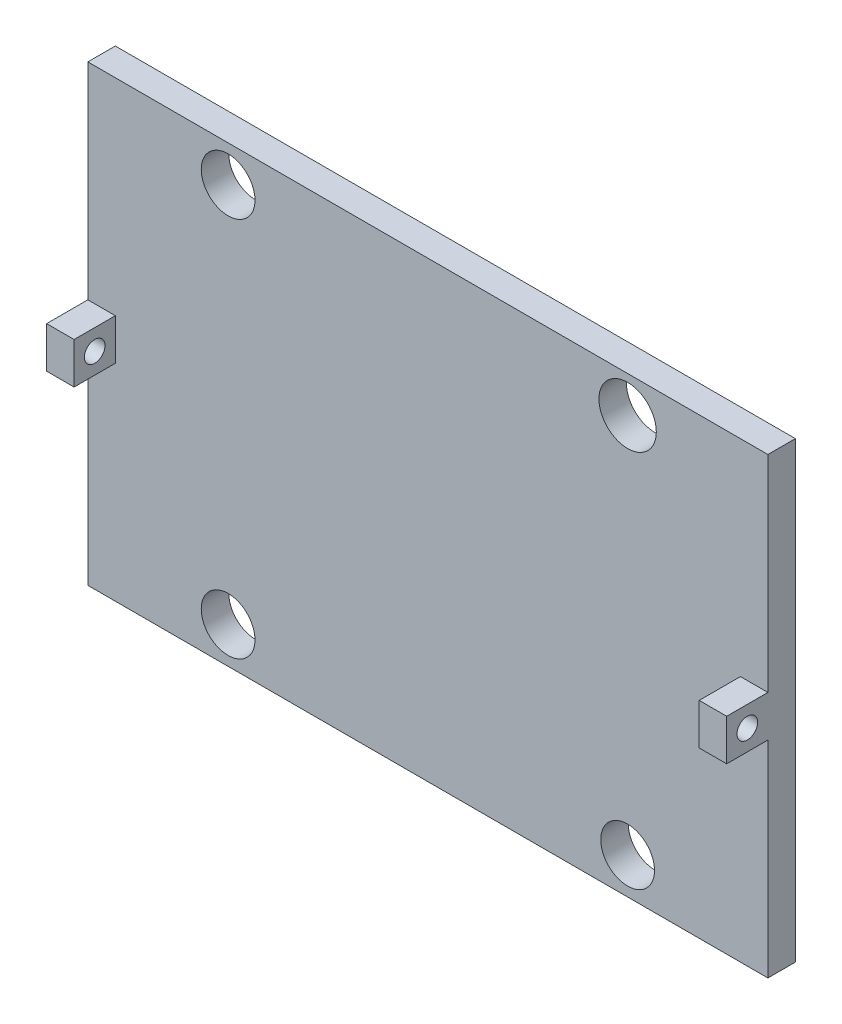
ISO-10303-21;
HEADER;
FILE_DESCRIPTION(('STEP AP214'),'2;1');
FILE_NAME('part.step','',(''),(''),'','','');
FILE_SCHEMA(('AUTOMOTIVE_DESIGN { 1 0 10303 214 1 1 1 1 }'));
ENDSEC;
DATA;
#1=APPLICATION_CONTEXT('core data for automotive mechanical design processes');
#2=APPLICATION_PROTOCOL_DEFINITION('international standard','automotive_design',2000,#1);
#3=PRODUCT_CONTEXT('',#1,'mechanical');
#4=PRODUCT('Part','Part','',(#3));
#5=PRODUCT_RELATED_PRODUCT_CATEGORY('part','',(#4));
#6=PRODUCT_DEFINITION_FORMATION('','',#4);
#7=PRODUCT_DEFINITION_CONTEXT('part definition',#1,'design');
#8=PRODUCT_DEFINITION('design','',#6,#7);
#9=PRODUCT_DEFINITION_SHAPE('','',#8);
#10=(LENGTH_UNIT() NAMED_UNIT(*) SI_UNIT(.MILLI.,.METRE.));
#11=(NAMED_UNIT(*) PLANE_ANGLE_UNIT() SI_UNIT($,.RADIAN.));
#12=(NAMED_UNIT(*) SI_UNIT($,.STERADIAN.) SOLID_ANGLE_UNIT());
#13=UNCERTAINTY_MEASURE_WITH_UNIT(LENGTH_MEASURE(1.E-05),#10,'distance_accuracy_value','');
#14=(GEOMETRIC_REPRESENTATION_CONTEXT(3) GLOBAL_UNCERTAINTY_ASSIGNED_CONTEXT((#13)) GLOBAL_UNIT_ASSIGNED_CONTEXT((#10,
#11,#12)) REPRESENTATION_CONTEXT('',''));
#15=CARTESIAN_POINT('',(0.,0.,0.));
#16=DIRECTION('',(0.,0.,1.));
#17=DIRECTION('',(1.,0.,0.));
#18=AXIS2_PLACEMENT_3D('',#15,#16,#17);
#19=CARTESIAN_POINT('',(0.,0.,2.));
#20=DIRECTION('',(0.,0.,1.));
#21=DIRECTION('',(1.,0.,0.));
#22=AXIS2_PLACEMENT_3D('',#19,#20,#21);
#23=PLANE('',#22);
#24=CARTESIAN_POINT('',(-21.5144389027431,-20.1717847880299,2.));
#25=DIRECTION('',(0.,0.,1.));
#26=DIRECTION('',(1.,0.,0.));
#27=AXIS2_PLACEMENT_3D('',#24,#25,#26);
#28=CIRCLE('',#27,1.9558);
#29=CARTESIAN_POINT('',(-19.5586389027431,-20.1717847880299,2.));
#30=VERTEX_POINT('',#29);
#31=EDGE_CURVE('E429',#30,#30,#28,.T.);
#32=ORIENTED_EDGE('',*,*,#31,.F.);
#33=EDGE_LOOP('',(#32));
#34=FACE_BOUND('',#33,.T.);
#35=CARTESIAN_POINT('',(-21.5144389027431,7.53961521197007,2.));
#36=DIRECTION('',(0.,0.,1.));
#37=DIRECTION('',(1.,0.,0.));
#38=AXIS2_PLACEMENT_3D('',#35,#36,#37);
#39=CIRCLE('',#38,1.9558);
#40=CARTESIAN_POINT('',(-19.5586389027431,7.53961521197007,2.));
#41=VERTEX_POINT('',#40);
#42=EDGE_CURVE('E439',#41,#41,#39,.T.);
#43=ORIENTED_EDGE('',*,*,#42,.F.);
#44=EDGE_LOOP('',(#43));
#45=FACE_BOUND('',#44,.T.);
#46=CARTESIAN_POINT('',(7.56556109725687,-20.1717847880299,2.));
#47=DIRECTION('',(0.,0.,1.));
#48=DIRECTION('',(1.,0.,0.));
#49=AXIS2_PLACEMENT_3D('',#46,#47,#48);
#50=CIRCLE('',#49,1.9558);
#51=CARTESIAN_POINT('',(9.52136109725687,-20.1717847880299,2.));
#52=VERTEX_POINT('',#51);
#53=EDGE_CURVE('E445',#52,#52,#50,.T.);
#54=ORIENTED_EDGE('',*,*,#53,.F.);
#55=EDGE_LOOP('',(#54));
#56=FACE_BOUND('',#55,.T.);
#57=CARTESIAN_POINT('',(7.56556109725687,7.53961521197007,2.));
#58=DIRECTION('',(0.,0.,1.));
#59=DIRECTION('',(1.,0.,0.));
#60=AXIS2_PLACEMENT_3D('',#57,#58,#59);
#61=CIRCLE('',#60,2.08701189447507);
#62=CARTESIAN_POINT('',(9.65257299173194,7.53961521197007,2.));
#63=VERTEX_POINT('',#62);
#64=EDGE_CURVE('E451',#63,#63,#61,.T.);
#65=ORIENTED_EDGE('',*,*,#64,.F.);
#66=EDGE_LOOP('',(#65));
#67=FACE_BOUND('',#66,.T.);
#68=DIRECTION('',(0.,1.,0.));
#69=VECTOR('',#68,1.);
#70=CARTESIAN_POINT('',(17.7755610972569,10.1839152119701,2.));
#71=LINE('',#70,#69);
#72=CARTESIAN_POINT('',(17.7755610972569,-22.8160847880299,2.));
#73=VERTEX_POINT('',#72);
#74=CARTESIAN_POINT('',(17.7755610972569,-7.81608478802993,2.));
#75=VERTEX_POINT('',#74);
#76=EDGE_CURVE('E233',#73,#75,#71,.T.);
#77=ORIENTED_EDGE('',*,*,#76,.T.);
#78=DIRECTION('',(1.,0.,0.));
#79=VECTOR('',#78,1.);
#80=CARTESIAN_POINT('',(17.7755610972569,-7.81608478802993,2.));
#81=LINE('',#80,#79);
#82=CARTESIAN_POINT('',(15.7755610972569,-7.81608478802993,2.));
#83=VERTEX_POINT('',#82);
#84=EDGE_CURVE('E157',#83,#75,#81,.T.);
#85=ORIENTED_EDGE('',*,*,#84,.F.);
#86=DIRECTION('',(0.,-1.,0.));
#87=VECTOR('',#86,1.);
#88=CARTESIAN_POINT('',(15.7755610972569,-7.81608478802993,2.));
#89=LINE('',#88,#87);
#90=CARTESIAN_POINT('',(15.7755610972569,-4.81608478802993,2.));
#91=VERTEX_POINT('',#90);
#92=EDGE_CURVE('E140',#91,#83,#89,.T.);
#93=ORIENTED_EDGE('',*,*,#92,.F.);
#94=DIRECTION('',(-1.,0.,0.));
#95=VECTOR('',#94,1.);
#96=CARTESIAN_POINT('',(15.7755610972569,-4.81608478802993,2.));
#97=LINE('',#96,#95);
#98=CARTESIAN_POINT('',(17.7755610972569,-4.81608478802993,2.));
#99=VERTEX_POINT('',#98);
#100=EDGE_CURVE('E134',#99,#91,#97,.T.);
#101=ORIENTED_EDGE('',*,*,#100,.F.);
#102=CARTESIAN_POINT('',(17.7755610972569,10.1839152119701,2.));
#103=VERTEX_POINT('',#102);
#104=EDGE_CURVE('E235',#99,#103,#71,.T.);
#105=ORIENTED_EDGE('',*,*,#104,.T.);
#106=DIRECTION('',(-1.,0.,0.));
#107=VECTOR('',#106,1.);
#108=CARTESIAN_POINT('',(-31.7244389027431,10.1839152119701,2.));
#109=LINE('',#108,#107);
#110=CARTESIAN_POINT('',(-31.7244389027431,10.1839152119701,2.));
#111=VERTEX_POINT('',#110);
#112=EDGE_CURVE('E224',#103,#111,#109,.T.);
#113=ORIENTED_EDGE('',*,*,#112,.T.);
#114=DIRECTION('',(0.,-1.,0.));
#115=VECTOR('',#114,1.);
#116=CARTESIAN_POINT('',(-31.7244389027431,10.1839152119701,2.));
#117=LINE('',#116,#115);
#118=CARTESIAN_POINT('',(-31.7244389027431,-4.81608478802993,2.));
#119=VERTEX_POINT('',#118);
#120=EDGE_CURVE('E214',#111,#119,#117,.T.);
#121=ORIENTED_EDGE('',*,*,#120,.T.);
#122=DIRECTION('',(-1.,0.,0.));
#123=VECTOR('',#122,1.);
#124=CARTESIAN_POINT('',(-31.7244389027431,-4.81608478802993,2.));
#125=LINE('',#124,#123);
#126=CARTESIAN_POINT('',(-29.7244389027431,-4.81608478802993,2.));
#127=VERTEX_POINT('',#126);
#128=EDGE_CURVE('E168',#127,#119,#125,.T.);
#129=ORIENTED_EDGE('',*,*,#128,.F.);
#130=DIRECTION('',(0.,1.,0.));
#131=VECTOR('',#130,1.);
#132=CARTESIAN_POINT('',(-29.7244389027431,-4.81608478802993,2.));
#133=LINE('',#132,#131);
#134=CARTESIAN_POINT('',(-29.7244389027431,-7.81608478802993,2.));
#135=VERTEX_POINT('',#134);
#136=EDGE_CURVE('E58',#135,#127,#133,.T.);
#137=ORIENTED_EDGE('',*,*,#136,.F.);
#138=DIRECTION('',(1.,0.,0.));
#139=VECTOR('',#138,1.);
#140=CARTESIAN_POINT('',(-29.7244389027431,-7.81608478802993,2.));
#141=LINE('',#140,#139);
#142=CARTESIAN_POINT('',(-31.7244389027431,-7.81608478802993,2.));
#143=VERTEX_POINT('',#142);
#144=EDGE_CURVE('E143',#143,#135,#141,.T.);
#145=ORIENTED_EDGE('',*,*,#144,.F.);
#146=CARTESIAN_POINT('',(-31.7244389027431,-22.8160847880299,2.));
#147=VERTEX_POINT('',#146);
#148=EDGE_CURVE('E211',#143,#147,#117,.T.);
#149=ORIENTED_EDGE('',*,*,#148,.T.);
#150=DIRECTION('',(1.,0.,0.));
#151=VECTOR('',#150,1.);
#152=CARTESIAN_POINT('',(-31.7244389027431,-22.8160847880299,2.));
#153=LINE('',#152,#151);
#154=EDGE_CURVE('E207',#147,#73,#153,.T.);
#155=ORIENTED_EDGE('',*,*,#154,.T.);
#156=EDGE_LOOP('',(#77,#85,#93,#101,#105,#113,#121,#129,#137,#145,#149,#155));
#157=FACE_BOUND('',#156,.T.);
#158=ADVANCED_FACE('F33',(#34,#45,#56,#67,#157),#23,.T.);
#159=CARTESIAN_POINT('',(-31.7244389027431,10.1839152119701,2.));
#160=DIRECTION('',(1.,0.,0.));
#161=DIRECTION('',(0.,0.,-1.));
#162=AXIS2_PLACEMENT_3D('',#159,#160,#161);
#163=PLANE('',#162);
#164=CARTESIAN_POINT('',(-31.7244389027431,-6.31608478802993,3.5));
#165=DIRECTION('',(-1.,0.,0.));
#166=DIRECTION('',(0.,0.,1.));
#167=AXIS2_PLACEMENT_3D('',#164,#165,#166);
#168=CIRCLE('',#167,0.75);
#169=CARTESIAN_POINT('',(-31.7244389027431,-6.31608478802993,4.25));
#170=VERTEX_POINT('',#169);
#171=EDGE_CURVE('E454',#170,#170,#168,.T.);
#172=ORIENTED_EDGE('',*,*,#171,.F.);
#173=EDGE_LOOP('',(#172));
#174=FACE_BOUND('',#173,.T.);
#175=DIRECTION('',(0.,-1.,0.));
#176=VECTOR('',#175,1.);
#177=CARTESIAN_POINT('',(-31.7244389027431,10.1839152119701,0.));
#178=LINE('',#177,#176);
#179=CARTESIAN_POINT('',(-31.7244389027431,10.1839152119701,0.));
#180=VERTEX_POINT('',#179);
#181=CARTESIAN_POINT('',(-31.7244389027431,-22.8160847880299,0.));
#182=VERTEX_POINT('',#181);
#183=EDGE_CURVE('E203',#180,#182,#178,.T.);
#184=ORIENTED_EDGE('',*,*,#183,.T.);
#185=DIRECTION('',(0.,0.,-1.));
#186=VECTOR('',#185,1.);
#187=CARTESIAN_POINT('',(-31.7244389027431,-22.8160847880299,2.));
#188=LINE('',#187,#186);
#189=EDGE_CURVE('E11',#147,#182,#188,.T.);
#190=ORIENTED_EDGE('',*,*,#189,.F.);
#191=ORIENTED_EDGE('',*,*,#148,.F.);
#192=DIRECTION('',(0.,0.,-1.));
#193=VECTOR('',#192,1.);
#194=CARTESIAN_POINT('',(-31.7244389027431,-7.81608478802993,5.));
#195=LINE('',#194,#193);
#196=CARTESIAN_POINT('',(-31.7244389027431,-7.81608478802993,5.));
#197=VERTEX_POINT('',#196);
#198=EDGE_CURVE('E198',#197,#143,#195,.T.);
#199=ORIENTED_EDGE('',*,*,#198,.F.);
#200=DIRECTION('',(0.,-1.,0.));
#201=VECTOR('',#200,1.);
#202=CARTESIAN_POINT('',(-31.7244389027431,-7.81608478802993,5.));
#203=LINE('',#202,#201);
#204=CARTESIAN_POINT('',(-31.7244389027431,-4.81608478802993,5.));
#205=VERTEX_POINT('',#204);
#206=EDGE_CURVE('E164',#205,#197,#203,.T.);
#207=ORIENTED_EDGE('',*,*,#206,.F.);
#208=DIRECTION('',(0.,0.,-1.));
#209=VECTOR('',#208,1.);
#210=CARTESIAN_POINT('',(-31.7244389027431,-4.81608478802993,5.));
#211=LINE('',#210,#209);
#212=EDGE_CURVE('E175',#205,#119,#211,.T.);
#213=ORIENTED_EDGE('',*,*,#212,.T.);
#214=ORIENTED_EDGE('',*,*,#120,.F.);
#215=DIRECTION('',(0.,0.,-1.));
#216=VECTOR('',#215,1.);
#217=CARTESIAN_POINT('',(-31.7244389027431,10.1839152119701,2.));
#218=LINE('',#217,#216);
#219=EDGE_CURVE('E221',#111,#180,#218,.T.);
#220=ORIENTED_EDGE('',*,*,#219,.T.);
#221=EDGE_LOOP('',(#184,#190,#191,#199,#207,#213,#214,#220));
#222=FACE_BOUND('',#221,.T.);
#223=ADVANCED_FACE('F35',(#174,#222),#163,.F.);
#224=CARTESIAN_POINT('',(-31.7244389027431,-22.8160847880299,2.));
#225=DIRECTION('',(0.,1.,0.));
#226=DIRECTION('',(0.,0.,1.));
#227=AXIS2_PLACEMENT_3D('',#224,#225,#226);
#228=PLANE('',#227);
#229=DIRECTION('',(1.,0.,0.));
#230=VECTOR('',#229,1.);
#231=CARTESIAN_POINT('',(-31.7244389027431,-22.8160847880299,0.));
#232=LINE('',#231,#230);
#233=CARTESIAN_POINT('',(17.7755610972569,-22.8160847880299,0.));
#234=VERTEX_POINT('',#233);
#235=EDGE_CURVE('E229',#182,#234,#232,.T.);
#236=ORIENTED_EDGE('',*,*,#235,.T.);
#237=DIRECTION('',(0.,0.,-1.));
#238=VECTOR('',#237,1.);
#239=CARTESIAN_POINT('',(17.7755610972569,-22.8160847880299,2.));
#240=LINE('',#239,#238);
#241=EDGE_CURVE('E42',#73,#234,#240,.T.);
#242=ORIENTED_EDGE('',*,*,#241,.F.);
#243=ORIENTED_EDGE('',*,*,#154,.F.);
#244=ORIENTED_EDGE('',*,*,#189,.T.);
#245=EDGE_LOOP('',(#236,#242,#243,#244));
#246=FACE_BOUND('',#245,.T.);
#247=ADVANCED_FACE('F244',(#246),#228,.F.);
#248=CARTESIAN_POINT('',(17.7755610972569,10.1839152119701,2.));
#249=DIRECTION('',(-1.,0.,0.));
#250=DIRECTION('',(0.,-1.,0.));
#251=AXIS2_PLACEMENT_3D('',#248,#249,#250);
#252=PLANE('',#251);
#253=CARTESIAN_POINT('',(17.7755610972569,-6.31608478802993,3.5));
#254=DIRECTION('',(-1.,0.,0.));
#255=DIRECTION('',(0.,-1.,0.));
#256=AXIS2_PLACEMENT_3D('',#253,#254,#255);
#257=CIRCLE('',#256,0.75);
#258=CARTESIAN_POINT('',(17.7755610972569,-7.06608478802993,3.5));
#259=VERTEX_POINT('',#258);
#260=EDGE_CURVE('E158',#259,#259,#257,.T.);
#261=ORIENTED_EDGE('',*,*,#260,.T.);
#262=EDGE_LOOP('',(#261));
#263=FACE_BOUND('',#262,.T.);
#264=DIRECTION('',(0.,1.,0.));
#265=VECTOR('',#264,1.);
#266=CARTESIAN_POINT('',(17.7755610972569,10.1839152119701,0.));
#267=LINE('',#266,#265);
#268=CARTESIAN_POINT('',(17.7755610972569,10.1839152119701,0.));
#269=VERTEX_POINT('',#268);
#270=EDGE_CURVE('E227',#234,#269,#267,.T.);
#271=ORIENTED_EDGE('',*,*,#270,.T.);
#272=DIRECTION('',(0.,0.,-1.));
#273=VECTOR('',#272,1.);
#274=CARTESIAN_POINT('',(17.7755610972569,10.1839152119701,2.));
#275=LINE('',#274,#273);
#276=EDGE_CURVE('E218',#103,#269,#275,.T.);
#277=ORIENTED_EDGE('',*,*,#276,.F.);
#278=ORIENTED_EDGE('',*,*,#104,.F.);
#279=DIRECTION('',(0.,0.,-1.));
#280=VECTOR('',#279,1.);
#281=CARTESIAN_POINT('',(17.7755610972569,-4.81608478802993,5.));
#282=LINE('',#281,#280);
#283=CARTESIAN_POINT('',(17.7755610972569,-4.81608478802993,5.));
#284=VERTEX_POINT('',#283);
#285=EDGE_CURVE('E50',#284,#99,#282,.T.);
#286=ORIENTED_EDGE('',*,*,#285,.F.);
#287=DIRECTION('',(0.,1.,0.));
#288=VECTOR('',#287,1.);
#289=CARTESIAN_POINT('',(17.7755610972569,-4.81608478802993,5.));
#290=LINE('',#289,#288);
#291=CARTESIAN_POINT('',(17.7755610972569,-7.81608478802993,5.));
#292=VERTEX_POINT('',#291);
#293=EDGE_CURVE('E149',#292,#284,#290,.T.);
#294=ORIENTED_EDGE('',*,*,#293,.F.);
#295=DIRECTION('',(0.,0.,-1.));
#296=VECTOR('',#295,1.);
#297=CARTESIAN_POINT('',(17.7755610972569,-7.81608478802993,5.));
#298=LINE('',#297,#296);
#299=EDGE_CURVE('E144',#292,#75,#298,.T.);
#300=ORIENTED_EDGE('',*,*,#299,.T.);
#301=ORIENTED_EDGE('',*,*,#76,.F.);
#302=ORIENTED_EDGE('',*,*,#241,.T.);
#303=EDGE_LOOP('',(#271,#277,#278,#286,#294,#300,#301,#302));
#304=FACE_BOUND('',#303,.T.);
#305=ADVANCED_FACE('F247',(#263,#304),#252,.F.);
#306=CARTESIAN_POINT('',(-31.7244389027431,10.1839152119701,2.));
#307=DIRECTION('',(0.,-1.,0.));
#308=DIRECTION('',(0.,0.,-1.));
#309=AXIS2_PLACEMENT_3D('',#306,#307,#308);
#310=PLANE('',#309);
#311=DIRECTION('',(-1.,0.,0.));
#312=VECTOR('',#311,1.);
#313=CARTESIAN_POINT('',(-31.7244389027431,10.1839152119701,0.));
#314=LINE('',#313,#312);
#315=EDGE_CURVE('E225',#269,#180,#314,.T.);
#316=ORIENTED_EDGE('',*,*,#315,.T.);
#317=ORIENTED_EDGE('',*,*,#219,.F.);
#318=ORIENTED_EDGE('',*,*,#112,.F.);
#319=ORIENTED_EDGE('',*,*,#276,.T.);
#320=EDGE_LOOP('',(#316,#317,#318,#319));
#321=FACE_BOUND('',#320,.T.);
#322=ADVANCED_FACE('F274',(#321),#310,.F.);
#323=CARTESIAN_POINT('',(0.,0.,0.));
#324=DIRECTION('',(0.,0.,1.));
#325=DIRECTION('',(1.,0.,0.));
#326=AXIS2_PLACEMENT_3D('',#323,#324,#325);
#327=PLANE('',#326);
#328=CARTESIAN_POINT('',(-21.5144389027431,-20.1717847880299,0.));
#329=DIRECTION('',(0.,0.,-1.));
#330=DIRECTION('',(-1.,0.,0.));
#331=AXIS2_PLACEMENT_3D('',#328,#329,#330);
#332=CIRCLE('',#331,1.9558);
#333=CARTESIAN_POINT('',(-23.4702389027431,-20.1717847880299,0.));
#334=VERTEX_POINT('',#333);
#335=EDGE_CURVE('E432',#334,#334,#332,.T.);
#336=ORIENTED_EDGE('',*,*,#335,.F.);
#337=EDGE_LOOP('',(#336));
#338=FACE_BOUND('',#337,.T.);
#339=CARTESIAN_POINT('',(-21.5144389027431,7.53961521197007,0.));
#340=DIRECTION('',(0.,0.,-1.));
#341=DIRECTION('',(-1.,0.,0.));
#342=AXIS2_PLACEMENT_3D('',#339,#340,#341);
#343=CIRCLE('',#342,1.9558);
#344=CARTESIAN_POINT('',(-23.4702389027431,7.53961521197007,0.));
#345=VERTEX_POINT('',#344);
#346=EDGE_CURVE('E434',#345,#345,#343,.T.);
#347=ORIENTED_EDGE('',*,*,#346,.F.);
#348=EDGE_LOOP('',(#347));
#349=FACE_BOUND('',#348,.T.);
#350=CARTESIAN_POINT('',(7.56556109725687,-20.1717847880299,0.));
#351=DIRECTION('',(0.,0.,-1.));
#352=DIRECTION('',(-1.,0.,0.));
#353=AXIS2_PLACEMENT_3D('',#350,#351,#352);
#354=CIRCLE('',#353,1.9558);
#355=CARTESIAN_POINT('',(5.60976109725687,-20.1717847880299,0.));
#356=VERTEX_POINT('',#355);
#357=EDGE_CURVE('E442',#356,#356,#354,.T.);
#358=ORIENTED_EDGE('',*,*,#357,.F.);
#359=EDGE_LOOP('',(#358));
#360=FACE_BOUND('',#359,.T.);
#361=CARTESIAN_POINT('',(7.56556109725687,7.53961521197007,0.));
#362=DIRECTION('',(0.,0.,-1.));
#363=DIRECTION('',(-1.,0.,0.));
#364=AXIS2_PLACEMENT_3D('',#361,#362,#363);
#365=CIRCLE('',#364,2.08701189447507);
#366=CARTESIAN_POINT('',(5.4785492027818,7.53961521197007,0.));
#367=VERTEX_POINT('',#366);
#368=EDGE_CURVE('E448',#367,#367,#365,.T.);
#369=ORIENTED_EDGE('',*,*,#368,.F.);
#370=EDGE_LOOP('',(#369));
#371=FACE_BOUND('',#370,.T.);
#372=ORIENTED_EDGE('',*,*,#183,.F.);
#373=ORIENTED_EDGE('',*,*,#315,.F.);
#374=ORIENTED_EDGE('',*,*,#270,.F.);
#375=ORIENTED_EDGE('',*,*,#235,.F.);
#376=EDGE_LOOP('',(#372,#373,#374,#375));
#377=FACE_BOUND('',#376,.T.);
#378=ADVANCED_FACE('F271',(#338,#349,#360,#371,#377),#327,.F.);
#379=CARTESIAN_POINT('',(-29.7244389027431,-7.81608478802993,5.));
#380=DIRECTION('',(0.,1.,0.));
#381=DIRECTION('',(0.,0.,1.));
#382=AXIS2_PLACEMENT_3D('',#379,#380,#381);
#383=PLANE('',#382);
#384=ORIENTED_EDGE('',*,*,#144,.T.);
#385=DIRECTION('',(0.,0.,-1.));
#386=VECTOR('',#385,1.);
#387=CARTESIAN_POINT('',(-29.7244389027431,-7.81608478802993,5.));
#388=LINE('',#387,#386);
#389=CARTESIAN_POINT('',(-29.7244389027431,-7.81608478802993,5.));
#390=VERTEX_POINT('',#389);
#391=EDGE_CURVE('E193',#390,#135,#388,.T.);
#392=ORIENTED_EDGE('',*,*,#391,.F.);
#393=DIRECTION('',(1.,0.,0.));
#394=VECTOR('',#393,1.);
#395=CARTESIAN_POINT('',(-29.7244389027431,-7.81608478802993,5.));
#396=LINE('',#395,#394);
#397=EDGE_CURVE('E167',#197,#390,#396,.T.);
#398=ORIENTED_EDGE('',*,*,#397,.F.);
#399=ORIENTED_EDGE('',*,*,#198,.T.);
#400=EDGE_LOOP('',(#384,#392,#398,#399));
#401=FACE_BOUND('',#400,.T.);
#402=ADVANCED_FACE('F269',(#401),#383,.F.);
#403=CARTESIAN_POINT('',(-29.7244389027431,-4.81608478802993,5.));
#404=DIRECTION('',(-1.,0.,0.));
#405=DIRECTION('',(0.,0.,1.));
#406=AXIS2_PLACEMENT_3D('',#403,#404,#405);
#407=PLANE('',#406);
#408=CARTESIAN_POINT('',(-29.7244389027431,-6.31608478802993,3.5));
#409=DIRECTION('',(-1.,0.,0.));
#410=DIRECTION('',(0.,0.,1.));
#411=AXIS2_PLACEMENT_3D('',#408,#409,#410);
#412=CIRCLE('',#411,0.75);
#413=CARTESIAN_POINT('',(-29.7244389027431,-6.31608478802993,4.25));
#414=VERTEX_POINT('',#413);
#415=EDGE_CURVE('E457',#414,#414,#412,.T.);
#416=ORIENTED_EDGE('',*,*,#415,.T.);
#417=EDGE_LOOP('',(#416));
#418=FACE_BOUND('',#417,.T.);
#419=ORIENTED_EDGE('',*,*,#136,.T.);
#420=DIRECTION('',(0.,0.,-1.));
#421=VECTOR('',#420,1.);
#422=CARTESIAN_POINT('',(-29.7244389027431,-4.81608478802993,5.));
#423=LINE('',#422,#421);
#424=CARTESIAN_POINT('',(-29.7244389027431,-4.81608478802993,5.));
#425=VERTEX_POINT('',#424);
#426=EDGE_CURVE('E179',#425,#127,#423,.T.);
#427=ORIENTED_EDGE('',*,*,#426,.F.);
#428=DIRECTION('',(0.,1.,0.));
#429=VECTOR('',#428,1.);
#430=CARTESIAN_POINT('',(-29.7244389027431,-4.81608478802993,5.));
#431=LINE('',#430,#429);
#432=EDGE_CURVE('E170',#390,#425,#431,.T.);
#433=ORIENTED_EDGE('',*,*,#432,.F.);
#434=ORIENTED_EDGE('',*,*,#391,.T.);
#435=EDGE_LOOP('',(#419,#427,#433,#434));
#436=FACE_BOUND('',#435,.T.);
#437=ADVANCED_FACE('F306',(#418,#436),#407,.F.);
#438=CARTESIAN_POINT('',(-31.7244389027431,-4.81608478802993,5.));
#439=DIRECTION('',(0.,-1.,0.));
#440=DIRECTION('',(0.,0.,-1.));
#441=AXIS2_PLACEMENT_3D('',#438,#439,#440);
#442=PLANE('',#441);
#443=ORIENTED_EDGE('',*,*,#128,.T.);
#444=ORIENTED_EDGE('',*,*,#212,.F.);
#445=DIRECTION('',(-1.,0.,0.));
#446=VECTOR('',#445,1.);
#447=CARTESIAN_POINT('',(-31.7244389027431,-4.81608478802993,5.));
#448=LINE('',#447,#446);
#449=EDGE_CURVE('E172',#425,#205,#448,.T.);
#450=ORIENTED_EDGE('',*,*,#449,.F.);
#451=ORIENTED_EDGE('',*,*,#426,.T.);
#452=EDGE_LOOP('',(#443,#444,#450,#451));
#453=FACE_BOUND('',#452,.T.);
#454=ADVANCED_FACE('F313',(#453),#442,.F.);
#455=CARTESIAN_POINT('',(0.,0.,5.));
#456=DIRECTION('',(0.,0.,-1.));
#457=DIRECTION('',(-1.,0.,0.));
#458=AXIS2_PLACEMENT_3D('',#455,#456,#457);
#459=PLANE('',#458);
#460=ORIENTED_EDGE('',*,*,#206,.T.);
#461=ORIENTED_EDGE('',*,*,#397,.T.);
#462=ORIENTED_EDGE('',*,*,#432,.T.);
#463=ORIENTED_EDGE('',*,*,#449,.T.);
#464=EDGE_LOOP('',(#460,#461,#462,#463));
#465=FACE_BOUND('',#464,.T.);
#466=ADVANCED_FACE('F320',(#465),#459,.F.);
#467=CARTESIAN_POINT('',(15.7755610972569,-7.81608478802993,5.));
#468=DIRECTION('',(1.,0.,0.));
#469=DIRECTION('',(0.,0.,-1.));
#470=AXIS2_PLACEMENT_3D('',#467,#468,#469);
#471=PLANE('',#470);
#472=CARTESIAN_POINT('',(15.7755610972569,-6.31608478802993,3.5));
#473=DIRECTION('',(1.,0.,0.));
#474=DIRECTION('',(0.,0.,-1.));
#475=AXIS2_PLACEMENT_3D('',#472,#473,#474);
#476=CIRCLE('',#475,0.75);
#477=CARTESIAN_POINT('',(15.7755610972569,-6.31608478802993,2.75));
#478=VERTEX_POINT('',#477);
#479=EDGE_CURVE('E37',#478,#478,#476,.T.);
#480=ORIENTED_EDGE('',*,*,#479,.T.);
#481=EDGE_LOOP('',(#480));
#482=FACE_BOUND('',#481,.T.);
#483=ORIENTED_EDGE('',*,*,#92,.T.);
#484=DIRECTION('',(0.,0.,-1.));
#485=VECTOR('',#484,1.);
#486=CARTESIAN_POINT('',(15.7755610972569,-7.81608478802993,5.));
#487=LINE('',#486,#485);
#488=CARTESIAN_POINT('',(15.7755610972569,-7.81608478802993,5.));
#489=VERTEX_POINT('',#488);
#490=EDGE_CURVE('E137',#489,#83,#487,.T.);
#491=ORIENTED_EDGE('',*,*,#490,.F.);
#492=DIRECTION('',(0.,-1.,0.));
#493=VECTOR('',#492,1.);
#494=CARTESIAN_POINT('',(15.7755610972569,-6.31608478802993,5.));
#495=LINE('',#494,#493);
#496=CARTESIAN_POINT('',(15.7755610972569,-4.81608478802993,5.));
#497=VERTEX_POINT('',#496);
#498=EDGE_CURVE('E124',#497,#489,#495,.T.);
#499=ORIENTED_EDGE('',*,*,#498,.F.);
#500=DIRECTION('',(0.,0.,-1.));
#501=VECTOR('',#500,1.);
#502=CARTESIAN_POINT('',(15.7755610972569,-4.81608478802993,5.));
#503=LINE('',#502,#501);
#504=EDGE_CURVE('E155',#497,#91,#503,.T.);
#505=ORIENTED_EDGE('',*,*,#504,.T.);
#506=EDGE_LOOP('',(#483,#491,#499,#505));
#507=FACE_BOUND('',#506,.T.);
#508=ADVANCED_FACE('F138',(#482,#507),#471,.F.);
#509=CARTESIAN_POINT('',(17.7755610972569,-7.81608478802993,5.));
#510=DIRECTION('',(0.,1.,0.));
#511=DIRECTION('',(0.,0.,1.));
#512=AXIS2_PLACEMENT_3D('',#509,#510,#511);
#513=PLANE('',#512);
#514=ORIENTED_EDGE('',*,*,#84,.T.);
#515=ORIENTED_EDGE('',*,*,#299,.F.);
#516=DIRECTION('',(1.,0.,0.));
#517=VECTOR('',#516,1.);
#518=CARTESIAN_POINT('',(17.7755610972569,-7.81608478802993,5.));
#519=LINE('',#518,#517);
#520=EDGE_CURVE('E128',#489,#292,#519,.T.);
#521=ORIENTED_EDGE('',*,*,#520,.F.);
#522=ORIENTED_EDGE('',*,*,#490,.T.);
#523=EDGE_LOOP('',(#514,#515,#521,#522));
#524=FACE_BOUND('',#523,.T.);
#525=ADVANCED_FACE('F146',(#524),#513,.F.);
#526=CARTESIAN_POINT('',(15.7755610972569,-4.81608478802993,5.));
#527=DIRECTION('',(0.,-1.,0.));
#528=DIRECTION('',(0.,0.,-1.));
#529=AXIS2_PLACEMENT_3D('',#526,#527,#528);
#530=PLANE('',#529);
#531=ORIENTED_EDGE('',*,*,#100,.T.);
#532=ORIENTED_EDGE('',*,*,#504,.F.);
#533=DIRECTION('',(-1.,0.,0.));
#534=VECTOR('',#533,1.);
#535=CARTESIAN_POINT('',(15.7755610972569,-4.81608478802993,5.));
#536=LINE('',#535,#534);
#537=EDGE_CURVE('E130',#284,#497,#536,.T.);
#538=ORIENTED_EDGE('',*,*,#537,.F.);
#539=ORIENTED_EDGE('',*,*,#285,.T.);
#540=EDGE_LOOP('',(#531,#532,#538,#539));
#541=FACE_BOUND('',#540,.T.);
#542=ADVANCED_FACE('F248',(#541),#530,.F.);
#543=CARTESIAN_POINT('',(0.,0.,5.));
#544=DIRECTION('',(0.,0.,-1.));
#545=DIRECTION('',(-1.,0.,0.));
#546=AXIS2_PLACEMENT_3D('',#543,#544,#545);
#547=PLANE('',#546);
#548=ORIENTED_EDGE('',*,*,#498,.T.);
#549=ORIENTED_EDGE('',*,*,#520,.T.);
#550=ORIENTED_EDGE('',*,*,#293,.T.);
#551=ORIENTED_EDGE('',*,*,#537,.T.);
#552=EDGE_LOOP('',(#548,#549,#550,#551));
#553=FACE_BOUND('',#552,.T.);
#554=ADVANCED_FACE('F126',(#553),#547,.F.);
#555=CARTESIAN_POINT('',(38.2755610972569,-6.31608478802993,3.5));
#556=DIRECTION('',(-1.,0.,0.));
#557=DIRECTION('',(0.,0.,1.));
#558=AXIS2_PLACEMENT_3D('',#555,#556,#557);
#559=CYLINDRICAL_SURFACE('',#558,0.75);
#560=ORIENTED_EDGE('',*,*,#479,.F.);
#561=EDGE_LOOP('',(#560));
#562=FACE_BOUND('',#561,.T.);
#563=ORIENTED_EDGE('',*,*,#260,.F.);
#564=EDGE_LOOP('',(#563));
#565=FACE_BOUND('',#564,.T.);
#566=ADVANCED_FACE('F255',(#562,#565),#559,.F.);
#567=ORIENTED_EDGE('',*,*,#171,.T.);
#568=EDGE_LOOP('',(#567));
#569=FACE_BOUND('',#568,.T.);
#570=ORIENTED_EDGE('',*,*,#415,.F.);
#571=EDGE_LOOP('',(#570));
#572=FACE_BOUND('',#571,.T.);
#573=ADVANCED_FACE('F392',(#569,#572),#559,.F.);
#574=CARTESIAN_POINT('',(7.56556109725687,7.53961521197007,70.));
#575=DIRECTION('',(0.,0.,-1.));
#576=DIRECTION('',(-1.,0.,0.));
#577=AXIS2_PLACEMENT_3D('',#574,#575,#576);
#578=CYLINDRICAL_SURFACE('',#577,2.08701189447507);
#579=ORIENTED_EDGE('',*,*,#64,.T.);
#580=EDGE_LOOP('',(#579));
#581=FACE_BOUND('',#580,.T.);
#582=ORIENTED_EDGE('',*,*,#368,.T.);
#583=EDGE_LOOP('',(#582));
#584=FACE_BOUND('',#583,.T.);
#585=ADVANCED_FACE('F396',(#581,#584),#578,.F.);
#586=CARTESIAN_POINT('',(7.56556109725687,-20.1717847880299,70.));
#587=DIRECTION('',(0.,0.,-1.));
#588=DIRECTION('',(-1.,0.,0.));
#589=AXIS2_PLACEMENT_3D('',#586,#587,#588);
#590=CYLINDRICAL_SURFACE('',#589,1.9558);
#591=ORIENTED_EDGE('',*,*,#53,.T.);
#592=EDGE_LOOP('',(#591));
#593=FACE_BOUND('',#592,.T.);
#594=ORIENTED_EDGE('',*,*,#357,.T.);
#595=EDGE_LOOP('',(#594));
#596=FACE_BOUND('',#595,.T.);
#597=ADVANCED_FACE('F413',(#593,#596),#590,.F.);
#598=CARTESIAN_POINT('',(-21.5144389027431,7.53961521197007,70.));
#599=DIRECTION('',(0.,0.,-1.));
#600=DIRECTION('',(-1.,0.,0.));
#601=AXIS2_PLACEMENT_3D('',#598,#599,#600);
#602=CYLINDRICAL_SURFACE('',#601,1.9558);
#603=ORIENTED_EDGE('',*,*,#42,.T.);
#604=EDGE_LOOP('',(#603));
#605=FACE_BOUND('',#604,.T.);
#606=ORIENTED_EDGE('',*,*,#346,.T.);
#607=EDGE_LOOP('',(#606));
#608=FACE_BOUND('',#607,.T.);
#609=ADVANCED_FACE('F417',(#605,#608),#602,.F.);
#610=CARTESIAN_POINT('',(-21.5144389027431,-20.1717847880299,70.));
#611=DIRECTION('',(0.,0.,-1.));
#612=DIRECTION('',(-1.,0.,0.));
#613=AXIS2_PLACEMENT_3D('',#610,#611,#612);
#614=CYLINDRICAL_SURFACE('',#613,1.9558);
#615=ORIENTED_EDGE('',*,*,#31,.T.);
#616=EDGE_LOOP('',(#615));
#617=FACE_BOUND('',#616,.T.);
#618=ORIENTED_EDGE('',*,*,#335,.T.);
#619=EDGE_LOOP('',(#618));
#620=FACE_BOUND('',#619,.T.);
#621=ADVANCED_FACE('F421',(#617,#620),#614,.F.);
#622=CLOSED_SHELL('',(#158,#223,#247,#305,#322,#378,#402,#437,#454,#466,#508,#525,#542,#554,
#566,#573,#585,#597,#609,#621));
#623=MANIFOLD_SOLID_BREP('B2',#622);
#624=ADVANCED_BREP_SHAPE_REPRESENTATION('',(#18,#623),#14);
#625=SHAPE_DEFINITION_REPRESENTATION(#9,#624);
ENDSEC;
END-ISO-10303-21;
